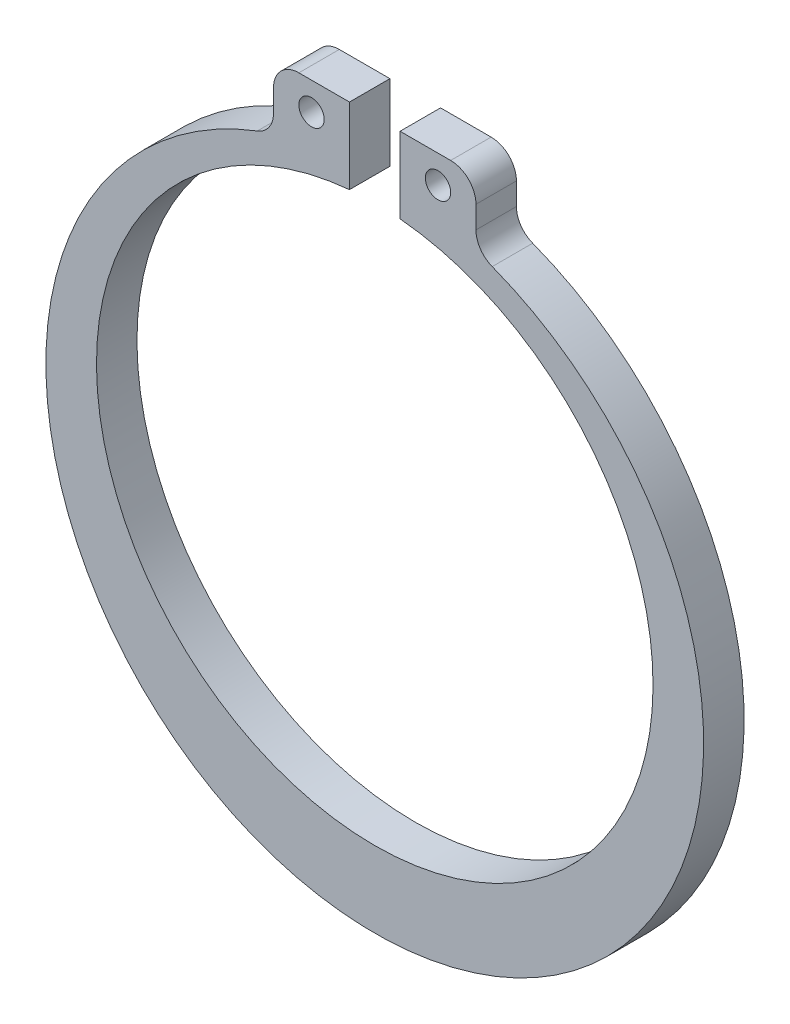
ISO-10303-21;
HEADER;
FILE_DESCRIPTION(('STEP AP214'),'2;1');
FILE_NAME('part.step','',(''),(''),'','','');
FILE_SCHEMA(('AUTOMOTIVE_DESIGN { 1 0 10303 214 1 1 1 1 }'));
ENDSEC;
DATA;
#1=APPLICATION_CONTEXT('core data for automotive mechanical design processes');
#2=APPLICATION_PROTOCOL_DEFINITION('international standard','automotive_design',2000,#1);
#3=PRODUCT_CONTEXT('',#1,'mechanical');
#4=PRODUCT('Part','Part','',(#3));
#5=PRODUCT_RELATED_PRODUCT_CATEGORY('part','',(#4));
#6=PRODUCT_DEFINITION_FORMATION('','',#4);
#7=PRODUCT_DEFINITION_CONTEXT('part definition',#1,'design');
#8=PRODUCT_DEFINITION('design','',#6,#7);
#9=PRODUCT_DEFINITION_SHAPE('','',#8);
#10=(LENGTH_UNIT() NAMED_UNIT(*) SI_UNIT(.MILLI.,.METRE.));
#11=(NAMED_UNIT(*) PLANE_ANGLE_UNIT() SI_UNIT($,.RADIAN.));
#12=(NAMED_UNIT(*) SI_UNIT($,.STERADIAN.) SOLID_ANGLE_UNIT());
#13=UNCERTAINTY_MEASURE_WITH_UNIT(LENGTH_MEASURE(1.E-05),#10,'distance_accuracy_value','');
#14=(GEOMETRIC_REPRESENTATION_CONTEXT(3) GLOBAL_UNCERTAINTY_ASSIGNED_CONTEXT((#13)) GLOBAL_UNIT_ASSIGNED_CONTEXT((#10,
#11,#12)) REPRESENTATION_CONTEXT('',''));
#15=CARTESIAN_POINT('',(0.,0.,0.));
#16=DIRECTION('',(0.,0.,1.));
#17=DIRECTION('',(1.,0.,0.));
#18=AXIS2_PLACEMENT_3D('',#15,#16,#17);
#19=CARTESIAN_POINT('',(0.5,0.,0.400000000000001));
#20=DIRECTION('',(1.,0.,0.));
#21=DIRECTION('',(0.,1.,0.));
#22=AXIS2_PLACEMENT_3D('',#19,#20,#21);
#23=PLANE('',#22);
#24=DIRECTION('',(0.,-1.,0.));
#25=VECTOR('',#24,1.);
#26=CARTESIAN_POINT('',(0.5,0.,-0.400000000000001));
#27=LINE('',#26,#25);
#28=CARTESIAN_POINT('',(0.5,6.97722557505166,-0.400000000000001));
#29=VERTEX_POINT('',#28);
#30=CARTESIAN_POINT('',(0.5,5.47722557505166,-0.400000000000001));
#31=VERTEX_POINT('',#30);
#32=EDGE_CURVE('E183',#29,#31,#27,.T.);
#33=ORIENTED_EDGE('',*,*,#32,.T.);
#34=DIRECTION('',(0.,0.,-1.));
#35=VECTOR('',#34,1.);
#36=CARTESIAN_POINT('',(0.5,5.47722557505166,0.400000000000001));
#37=LINE('',#36,#35);
#38=CARTESIAN_POINT('',(0.5,5.47722557505166,0.400000000000001));
#39=VERTEX_POINT('',#38);
#40=EDGE_CURVE('E197',#39,#31,#37,.T.);
#41=ORIENTED_EDGE('',*,*,#40,.F.);
#42=DIRECTION('',(0.,-1.,0.));
#43=VECTOR('',#42,1.);
#44=CARTESIAN_POINT('',(0.5,0.,0.400000000000001));
#45=LINE('',#44,#43);
#46=CARTESIAN_POINT('',(0.5,6.97722557505166,0.400000000000001));
#47=VERTEX_POINT('',#46);
#48=EDGE_CURVE('E167',#47,#39,#45,.T.);
#49=ORIENTED_EDGE('',*,*,#48,.F.);
#50=DIRECTION('',(0.,0.,-1.));
#51=VECTOR('',#50,1.);
#52=CARTESIAN_POINT('',(0.5,6.97722557505166,0.400000000000001));
#53=LINE('',#52,#51);
#54=EDGE_CURVE('E180',#47,#29,#53,.T.);
#55=ORIENTED_EDGE('',*,*,#54,.T.);
#56=EDGE_LOOP('',(#33,#41,#49,#55));
#57=FACE_BOUND('',#56,.T.);
#58=ADVANCED_FACE('F36',(#57),#23,.F.);
#59=CARTESIAN_POINT('',(0.,0.,0.400000000000001));
#60=DIRECTION('',(0.,0.,-1.));
#61=DIRECTION('',(-1.,0.,0.));
#62=AXIS2_PLACEMENT_3D('',#59,#60,#61);
#63=CYLINDRICAL_SURFACE('',#62,5.5);
#64=CARTESIAN_POINT('',(0.,0.,-0.400000000000001));
#65=DIRECTION('',(0.,0.,1.));
#66=DIRECTION('',(1.,0.,0.));
#67=AXIS2_PLACEMENT_3D('',#64,#65,#66);
#68=CIRCLE('',#67,5.5);
#69=CARTESIAN_POINT('',(-0.5,5.47722557505166,-0.400000000000001));
#70=VERTEX_POINT('',#69);
#71=EDGE_CURVE('E186',#31,#70,#68,.F.);
#72=ORIENTED_EDGE('',*,*,#71,.T.);
#73=DIRECTION('',(0.,0.,-1.));
#74=VECTOR('',#73,1.);
#75=CARTESIAN_POINT('',(-0.5,5.47722557505166,0.400000000000001));
#76=LINE('',#75,#74);
#77=CARTESIAN_POINT('',(-0.5,5.47722557505166,0.400000000000001));
#78=VERTEX_POINT('',#77);
#79=EDGE_CURVE('E134',#78,#70,#76,.T.);
#80=ORIENTED_EDGE('',*,*,#79,.F.);
#81=CARTESIAN_POINT('',(0.,0.,0.400000000000001));
#82=DIRECTION('',(0.,0.,1.));
#83=DIRECTION('',(1.,0.,0.));
#84=AXIS2_PLACEMENT_3D('',#81,#82,#83);
#85=CIRCLE('',#84,5.5);
#86=EDGE_CURVE('E145',#39,#78,#85,.F.);
#87=ORIENTED_EDGE('',*,*,#86,.F.);
#88=ORIENTED_EDGE('',*,*,#40,.T.);
#89=EDGE_LOOP('',(#72,#80,#87,#88));
#90=FACE_BOUND('',#89,.T.);
#91=ADVANCED_FACE('F267',(#90),#63,.F.);
#92=CARTESIAN_POINT('',(0.,-0.5,0.400000000000001));
#93=DIRECTION('',(0.,0.,-1.));
#94=DIRECTION('',(-1.,0.,0.));
#95=AXIS2_PLACEMENT_3D('',#92,#93,#94);
#96=CYLINDRICAL_SURFACE('',#95,6.5);
#97=CARTESIAN_POINT('',(0.,-0.5,0.400000000000001));
#98=DIRECTION('',(0.,0.,1.));
#99=DIRECTION('',(1.,0.,0.));
#100=AXIS2_PLACEMENT_3D('',#97,#98,#99);
#101=CIRCLE('',#100,6.5);
#102=CARTESIAN_POINT('',(2.32142857142857,5.57132352850308,0.400000000000001));
#103=VERTEX_POINT('',#102);
#104=CARTESIAN_POINT('',(-2.32142857142857,5.57132352850308,0.400000000000001));
#105=VERTEX_POINT('',#104);
#106=EDGE_CURVE('E171',#103,#105,#101,.F.);
#107=ORIENTED_EDGE('',*,*,#106,.T.);
#108=DIRECTION('',(0.,0.,-1.));
#109=VECTOR('',#108,1.);
#110=CARTESIAN_POINT('',(-2.32142857142857,5.57132352850308,0.400000000000001));
#111=LINE('',#110,#109);
#112=CARTESIAN_POINT('',(-2.32142857142857,5.57132352850308,-0.400000000000001));
#113=VERTEX_POINT('',#112);
#114=EDGE_CURVE('E218',#105,#113,#111,.T.);
#115=ORIENTED_EDGE('',*,*,#114,.T.);
#116=CARTESIAN_POINT('',(0.,-0.5,-0.400000000000001));
#117=DIRECTION('',(0.,0.,1.));
#118=DIRECTION('',(1.,0.,0.));
#119=AXIS2_PLACEMENT_3D('',#116,#117,#118);
#120=CIRCLE('',#119,6.5);
#121=CARTESIAN_POINT('',(2.32142857142857,5.57132352850308,-0.400000000000001));
#122=VERTEX_POINT('',#121);
#123=EDGE_CURVE('E188',#122,#113,#120,.F.);
#124=ORIENTED_EDGE('',*,*,#123,.F.);
#125=DIRECTION('',(0.,0.,-1.));
#126=VECTOR('',#125,1.);
#127=CARTESIAN_POINT('',(2.32142857142857,5.57132352850308,0.400000000000001));
#128=LINE('',#127,#126);
#129=EDGE_CURVE('E205',#122,#103,#128,.F.);
#130=ORIENTED_EDGE('',*,*,#129,.T.);
#131=EDGE_LOOP('',(#107,#115,#124,#130));
#132=FACE_BOUND('',#131,.T.);
#133=ADVANCED_FACE('F244',(#132),#96,.T.);
#134=CARTESIAN_POINT('',(2.,0.,0.400000000000001));
#135=DIRECTION('',(1.,0.,0.));
#136=DIRECTION('',(0.,1.,0.));
#137=AXIS2_PLACEMENT_3D('',#134,#135,#136);
#138=PLANE('',#137);
#139=DIRECTION('',(0.,-1.,0.));
#140=VECTOR('',#139,1.);
#141=CARTESIAN_POINT('',(2.,0.,0.400000000000001));
#142=LINE('',#141,#140);
#143=CARTESIAN_POINT('',(2.,6.47722557505166,0.400000000000001));
#144=VERTEX_POINT('',#143);
#145=CARTESIAN_POINT('',(2.,6.03834841531101,0.400000000000001));
#146=VERTEX_POINT('',#145);
#147=EDGE_CURVE('E174',#144,#146,#142,.T.);
#148=ORIENTED_EDGE('',*,*,#147,.T.);
#149=DIRECTION('',(0.,0.,1.));
#150=VECTOR('',#149,1.);
#151=CARTESIAN_POINT('',(2.,6.03834841531101,-0.400000000000001));
#152=LINE('',#151,#150);
#153=CARTESIAN_POINT('',(2.,6.03834841531101,-0.400000000000001));
#154=VERTEX_POINT('',#153);
#155=EDGE_CURVE('E202',#146,#154,#152,.F.);
#156=ORIENTED_EDGE('',*,*,#155,.T.);
#157=DIRECTION('',(0.,-1.,0.));
#158=VECTOR('',#157,1.);
#159=CARTESIAN_POINT('',(2.,0.,-0.400000000000001));
#160=LINE('',#159,#158);
#161=CARTESIAN_POINT('',(2.,6.47722557505166,-0.400000000000001));
#162=VERTEX_POINT('',#161);
#163=EDGE_CURVE('E191',#162,#154,#160,.T.);
#164=ORIENTED_EDGE('',*,*,#163,.F.);
#165=DIRECTION('',(0.,0.,-1.));
#166=VECTOR('',#165,1.);
#167=CARTESIAN_POINT('',(2.,6.47722557505166,0.400000000000001));
#168=LINE('',#167,#166);
#169=EDGE_CURVE('E200',#162,#144,#168,.F.);
#170=ORIENTED_EDGE('',*,*,#169,.T.);
#171=EDGE_LOOP('',(#148,#156,#164,#170));
#172=FACE_BOUND('',#171,.T.);
#173=ADVANCED_FACE('F252',(#172),#138,.T.);
#174=CARTESIAN_POINT('',(1.25,6.4279504930691,0.400000000000001));
#175=DIRECTION('',(0.,0.,-1.));
#176=DIRECTION('',(-1.,0.,0.));
#177=AXIS2_PLACEMENT_3D('',#174,#175,#176);
#178=CYLINDRICAL_SURFACE('',#177,0.25);
#179=CARTESIAN_POINT('',(1.25,6.4279504930691,0.400000000000001));
#180=DIRECTION('',(0.,0.,1.));
#181=DIRECTION('',(1.,0.,0.));
#182=AXIS2_PLACEMENT_3D('',#179,#180,#181);
#183=CIRCLE('',#182,0.25);
#184=CARTESIAN_POINT('',(1.5,6.4279504930691,0.400000000000001));
#185=VERTEX_POINT('',#184);
#186=EDGE_CURVE('E164',#185,#185,#183,.T.);
#187=ORIENTED_EDGE('',*,*,#186,.T.);
#188=EDGE_LOOP('',(#187));
#189=FACE_BOUND('',#188,.T.);
#190=CARTESIAN_POINT('',(1.25,6.4279504930691,-0.400000000000001));
#191=DIRECTION('',(0.,0.,1.));
#192=DIRECTION('',(1.,0.,0.));
#193=AXIS2_PLACEMENT_3D('',#190,#191,#192);
#194=CIRCLE('',#193,0.25);
#195=CARTESIAN_POINT('',(1.5,6.4279504930691,-0.400000000000001));
#196=VERTEX_POINT('',#195);
#197=EDGE_CURVE('E133',#196,#196,#194,.T.);
#198=ORIENTED_EDGE('',*,*,#197,.F.);
#199=EDGE_LOOP('',(#198));
#200=FACE_BOUND('',#199,.T.);
#201=ADVANCED_FACE('F282',(#189,#200),#178,.F.);
#202=CARTESIAN_POINT('',(0.,6.97722557505166,0.400000000000001));
#203=DIRECTION('',(0.,1.,0.));
#204=DIRECTION('',(0.,0.,1.));
#205=AXIS2_PLACEMENT_3D('',#202,#203,#204);
#206=PLANE('',#205);
#207=DIRECTION('',(1.,0.,0.));
#208=VECTOR('',#207,1.);
#209=CARTESIAN_POINT('',(0.,6.97722557505166,0.400000000000001));
#210=LINE('',#209,#208);
#211=CARTESIAN_POINT('',(1.5,6.97722557505166,0.400000000000001));
#212=VERTEX_POINT('',#211);
#213=EDGE_CURVE('E177',#47,#212,#210,.T.);
#214=ORIENTED_EDGE('',*,*,#213,.T.);
#215=DIRECTION('',(0.,0.,-1.));
#216=VECTOR('',#215,1.);
#217=CARTESIAN_POINT('',(1.5,6.97722557505166,0.400000000000001));
#218=LINE('',#217,#216);
#219=CARTESIAN_POINT('',(1.5,6.97722557505166,-0.400000000000001));
#220=VERTEX_POINT('',#219);
#221=EDGE_CURVE('E207',#212,#220,#218,.T.);
#222=ORIENTED_EDGE('',*,*,#221,.T.);
#223=DIRECTION('',(1.,0.,0.));
#224=VECTOR('',#223,1.);
#225=CARTESIAN_POINT('',(0.,6.97722557505166,-0.400000000000001));
#226=LINE('',#225,#224);
#227=EDGE_CURVE('E168',#29,#220,#226,.T.);
#228=ORIENTED_EDGE('',*,*,#227,.F.);
#229=ORIENTED_EDGE('',*,*,#54,.F.);
#230=EDGE_LOOP('',(#214,#222,#228,#229));
#231=FACE_BOUND('',#230,.T.);
#232=ADVANCED_FACE('F260',(#231),#206,.T.);
#233=CARTESIAN_POINT('',(0.,0.,0.400000000000001));
#234=DIRECTION('',(0.,0.,1.));
#235=DIRECTION('',(1.,0.,0.));
#236=AXIS2_PLACEMENT_3D('',#233,#234,#235);
#237=PLANE('',#236);
#238=ORIENTED_EDGE('',*,*,#186,.F.);
#239=EDGE_LOOP('',(#238));
#240=FACE_BOUND('',#239,.T.);
#241=DIRECTION('',(-1.,0.,0.));
#242=VECTOR('',#241,1.);
#243=CARTESIAN_POINT('',(0.,6.97722557505166,0.400000000000001));
#244=LINE('',#243,#242);
#245=CARTESIAN_POINT('',(-0.5,6.97722557505166,0.400000000000001));
#246=VERTEX_POINT('',#245);
#247=CARTESIAN_POINT('',(-1.5,6.97722557505166,0.400000000000001));
#248=VERTEX_POINT('',#247);
#249=EDGE_CURVE('E136',#246,#248,#244,.T.);
#250=ORIENTED_EDGE('',*,*,#249,.T.);
#251=CARTESIAN_POINT('',(-1.5,6.47722557505166,0.400000000000001));
#252=DIRECTION('',(0.,0.,1.));
#253=DIRECTION('',(1.,0.,0.));
#254=AXIS2_PLACEMENT_3D('',#251,#252,#253);
#255=CIRCLE('',#254,0.5);
#256=CARTESIAN_POINT('',(-2.,6.47722557505166,0.400000000000001));
#257=VERTEX_POINT('',#256);
#258=EDGE_CURVE('E228',#248,#257,#255,.T.);
#259=ORIENTED_EDGE('',*,*,#258,.T.);
#260=DIRECTION('',(0.,-1.,0.));
#261=VECTOR('',#260,1.);
#262=CARTESIAN_POINT('',(-2.,0.,0.400000000000001));
#263=LINE('',#262,#261);
#264=CARTESIAN_POINT('',(-2.,6.03834841531101,0.400000000000001));
#265=VERTEX_POINT('',#264);
#266=EDGE_CURVE('E140',#257,#265,#263,.T.);
#267=ORIENTED_EDGE('',*,*,#266,.T.);
#268=CARTESIAN_POINT('',(-2.5,6.03834841531101,0.400000000000001));
#269=DIRECTION('',(0.,0.,1.));
#270=DIRECTION('',(1.,0.,0.));
#271=AXIS2_PLACEMENT_3D('',#268,#269,#270);
#272=CIRCLE('',#271,0.5);
#273=EDGE_CURVE('E11',#265,#105,#272,.F.);
#274=ORIENTED_EDGE('',*,*,#273,.T.);
#275=ORIENTED_EDGE('',*,*,#106,.F.);
#276=CARTESIAN_POINT('',(2.5,6.03834841531101,0.400000000000001));
#277=DIRECTION('',(0.,0.,1.));
#278=DIRECTION('',(1.,0.,0.));
#279=AXIS2_PLACEMENT_3D('',#276,#277,#278);
#280=CIRCLE('',#279,0.5);
#281=EDGE_CURVE('E216',#103,#146,#280,.F.);
#282=ORIENTED_EDGE('',*,*,#281,.T.);
#283=ORIENTED_EDGE('',*,*,#147,.F.);
#284=CARTESIAN_POINT('',(1.5,6.47722557505166,0.400000000000001));
#285=DIRECTION('',(0.,0.,1.));
#286=DIRECTION('',(1.,0.,0.));
#287=AXIS2_PLACEMENT_3D('',#284,#285,#286);
#288=CIRCLE('',#287,0.5);
#289=EDGE_CURVE('E212',#144,#212,#288,.T.);
#290=ORIENTED_EDGE('',*,*,#289,.T.);
#291=ORIENTED_EDGE('',*,*,#213,.F.);
#292=ORIENTED_EDGE('',*,*,#48,.T.);
#293=ORIENTED_EDGE('',*,*,#86,.T.);
#294=DIRECTION('',(0.,-1.,0.));
#295=VECTOR('',#294,1.);
#296=CARTESIAN_POINT('',(-0.5,0.,0.400000000000001));
#297=LINE('',#296,#295);
#298=EDGE_CURVE('E130',#246,#78,#297,.T.);
#299=ORIENTED_EDGE('',*,*,#298,.F.);
#300=EDGE_LOOP('',(#250,#259,#267,#274,#275,#282,#283,#290,#291,#292,#293,#299));
#301=FACE_BOUND('',#300,.T.);
#302=CARTESIAN_POINT('',(-1.25,6.4279504930691,0.400000000000001));
#303=DIRECTION('',(0.,0.,-1.));
#304=DIRECTION('',(-1.,0.,0.));
#305=AXIS2_PLACEMENT_3D('',#302,#303,#304);
#306=CIRCLE('',#305,0.25);
#307=CARTESIAN_POINT('',(-1.5,6.4279504930691,0.400000000000001));
#308=VERTEX_POINT('',#307);
#309=EDGE_CURVE('E147',#308,#308,#306,.T.);
#310=ORIENTED_EDGE('',*,*,#309,.T.);
#311=EDGE_LOOP('',(#310));
#312=FACE_BOUND('',#311,.T.);
#313=ADVANCED_FACE('F142',(#240,#301,#312),#237,.T.);
#314=CARTESIAN_POINT('',(0.,0.,-0.400000000000001));
#315=DIRECTION('',(0.,0.,1.));
#316=DIRECTION('',(1.,0.,0.));
#317=AXIS2_PLACEMENT_3D('',#314,#315,#316);
#318=PLANE('',#317);
#319=ORIENTED_EDGE('',*,*,#197,.T.);
#320=EDGE_LOOP('',(#319));
#321=FACE_BOUND('',#320,.T.);
#322=DIRECTION('',(0.,-1.,0.));
#323=VECTOR('',#322,1.);
#324=CARTESIAN_POINT('',(-2.,0.,-0.400000000000001));
#325=LINE('',#324,#323);
#326=CARTESIAN_POINT('',(-2.,6.47722557505166,-0.400000000000001));
#327=VERTEX_POINT('',#326);
#328=CARTESIAN_POINT('',(-2.,6.03834841531101,-0.400000000000001));
#329=VERTEX_POINT('',#328);
#330=EDGE_CURVE('E150',#327,#329,#325,.T.);
#331=ORIENTED_EDGE('',*,*,#330,.F.);
#332=CARTESIAN_POINT('',(-1.5,6.47722557505166,-0.400000000000001));
#333=DIRECTION('',(0.,0.,1.));
#334=DIRECTION('',(1.,0.,0.));
#335=AXIS2_PLACEMENT_3D('',#332,#333,#334);
#336=CIRCLE('',#335,0.5);
#337=CARTESIAN_POINT('',(-1.5,6.97722557505166,-0.400000000000001));
#338=VERTEX_POINT('',#337);
#339=EDGE_CURVE('E59',#327,#338,#336,.F.);
#340=ORIENTED_EDGE('',*,*,#339,.T.);
#341=DIRECTION('',(-1.,0.,0.));
#342=VECTOR('',#341,1.);
#343=CARTESIAN_POINT('',(0.,6.97722557505166,-0.400000000000001));
#344=LINE('',#343,#342);
#345=CARTESIAN_POINT('',(-0.5,6.97722557505166,-0.400000000000001));
#346=VERTEX_POINT('',#345);
#347=EDGE_CURVE('E159',#346,#338,#344,.T.);
#348=ORIENTED_EDGE('',*,*,#347,.F.);
#349=DIRECTION('',(0.,-1.,0.));
#350=VECTOR('',#349,1.);
#351=CARTESIAN_POINT('',(-0.5,0.,-0.400000000000001));
#352=LINE('',#351,#350);
#353=EDGE_CURVE('E132',#346,#70,#352,.T.);
#354=ORIENTED_EDGE('',*,*,#353,.T.);
#355=ORIENTED_EDGE('',*,*,#71,.F.);
#356=ORIENTED_EDGE('',*,*,#32,.F.);
#357=ORIENTED_EDGE('',*,*,#227,.T.);
#358=CARTESIAN_POINT('',(1.5,6.47722557505166,-0.400000000000001));
#359=DIRECTION('',(0.,0.,1.));
#360=DIRECTION('',(1.,0.,0.));
#361=AXIS2_PLACEMENT_3D('',#358,#359,#360);
#362=CIRCLE('',#361,0.5);
#363=EDGE_CURVE('E210',#220,#162,#362,.F.);
#364=ORIENTED_EDGE('',*,*,#363,.T.);
#365=ORIENTED_EDGE('',*,*,#163,.T.);
#366=CARTESIAN_POINT('',(2.5,6.03834841531101,-0.400000000000001));
#367=DIRECTION('',(0.,0.,1.));
#368=DIRECTION('',(1.,0.,0.));
#369=AXIS2_PLACEMENT_3D('',#366,#367,#368);
#370=CIRCLE('',#369,0.5);
#371=EDGE_CURVE('E214',#154,#122,#370,.T.);
#372=ORIENTED_EDGE('',*,*,#371,.T.);
#373=ORIENTED_EDGE('',*,*,#123,.T.);
#374=CARTESIAN_POINT('',(-2.5,6.03834841531101,-0.400000000000001));
#375=DIRECTION('',(0.,0.,1.));
#376=DIRECTION('',(1.,0.,0.));
#377=AXIS2_PLACEMENT_3D('',#374,#375,#376);
#378=CIRCLE('',#377,0.5);
#379=EDGE_CURVE('E44',#113,#329,#378,.T.);
#380=ORIENTED_EDGE('',*,*,#379,.T.);
#381=EDGE_LOOP('',(#331,#340,#348,#354,#355,#356,#357,#364,#365,#372,#373,#380));
#382=FACE_BOUND('',#381,.T.);
#383=CARTESIAN_POINT('',(-1.25,6.4279504930691,-0.400000000000001));
#384=DIRECTION('',(0.,0.,-1.));
#385=DIRECTION('',(-1.,0.,0.));
#386=AXIS2_PLACEMENT_3D('',#383,#384,#385);
#387=CIRCLE('',#386,0.25);
#388=CARTESIAN_POINT('',(-1.5,6.4279504930691,-0.400000000000001));
#389=VERTEX_POINT('',#388);
#390=EDGE_CURVE('E155',#389,#389,#387,.T.);
#391=ORIENTED_EDGE('',*,*,#390,.F.);
#392=EDGE_LOOP('',(#391));
#393=FACE_BOUND('',#392,.T.);
#394=ADVANCED_FACE('F229',(#321,#382,#393),#318,.F.);
#395=CARTESIAN_POINT('',(2.5,6.03834841531101,0.400000000000001));
#396=DIRECTION('',(0.,0.,-1.));
#397=DIRECTION('',(-1.,0.,0.));
#398=AXIS2_PLACEMENT_3D('',#395,#396,#397);
#399=CYLINDRICAL_SURFACE('',#398,0.5);
#400=ORIENTED_EDGE('',*,*,#281,.F.);
#401=ORIENTED_EDGE('',*,*,#129,.F.);
#402=ORIENTED_EDGE('',*,*,#371,.F.);
#403=ORIENTED_EDGE('',*,*,#155,.F.);
#404=EDGE_LOOP('',(#400,#401,#402,#403));
#405=FACE_BOUND('',#404,.T.);
#406=ADVANCED_FACE('F247',(#405),#399,.F.);
#407=CARTESIAN_POINT('',(1.5,6.47722557505166,0.400000000000001));
#408=DIRECTION('',(0.,0.,-1.));
#409=DIRECTION('',(-1.,0.,0.));
#410=AXIS2_PLACEMENT_3D('',#407,#408,#409);
#411=CYLINDRICAL_SURFACE('',#410,0.5);
#412=ORIENTED_EDGE('',*,*,#289,.F.);
#413=ORIENTED_EDGE('',*,*,#169,.F.);
#414=ORIENTED_EDGE('',*,*,#363,.F.);
#415=ORIENTED_EDGE('',*,*,#221,.F.);
#416=EDGE_LOOP('',(#412,#413,#414,#415));
#417=FACE_BOUND('',#416,.T.);
#418=ADVANCED_FACE('F256',(#417),#411,.T.);
#419=CARTESIAN_POINT('',(-0.5,0.,0.400000000000001));
#420=DIRECTION('',(1.,0.,0.));
#421=DIRECTION('',(0.,1.,0.));
#422=AXIS2_PLACEMENT_3D('',#419,#420,#421);
#423=PLANE('',#422);
#424=ORIENTED_EDGE('',*,*,#353,.F.);
#425=DIRECTION('',(0.,0.,-1.));
#426=VECTOR('',#425,1.);
#427=CARTESIAN_POINT('',(-0.5,6.97722557505166,0.400000000000001));
#428=LINE('',#427,#426);
#429=EDGE_CURVE('E126',#246,#346,#428,.T.);
#430=ORIENTED_EDGE('',*,*,#429,.F.);
#431=ORIENTED_EDGE('',*,*,#298,.T.);
#432=ORIENTED_EDGE('',*,*,#79,.T.);
#433=EDGE_LOOP('',(#424,#430,#431,#432));
#434=FACE_BOUND('',#433,.T.);
#435=ADVANCED_FACE('F127',(#434),#423,.T.);
#436=CARTESIAN_POINT('',(0.,6.97722557505166,0.400000000000001));
#437=DIRECTION('',(0.,-1.,0.));
#438=DIRECTION('',(0.,0.,-1.));
#439=AXIS2_PLACEMENT_3D('',#436,#437,#438);
#440=PLANE('',#439);
#441=ORIENTED_EDGE('',*,*,#347,.T.);
#442=DIRECTION('',(0.,0.,-1.));
#443=VECTOR('',#442,1.);
#444=CARTESIAN_POINT('',(-1.5,6.97722557505166,0.400000000000001));
#445=LINE('',#444,#443);
#446=EDGE_CURVE('E51',#338,#248,#445,.F.);
#447=ORIENTED_EDGE('',*,*,#446,.T.);
#448=ORIENTED_EDGE('',*,*,#249,.F.);
#449=ORIENTED_EDGE('',*,*,#429,.T.);
#450=EDGE_LOOP('',(#441,#447,#448,#449));
#451=FACE_BOUND('',#450,.T.);
#452=ADVANCED_FACE('F137',(#451),#440,.F.);
#453=CARTESIAN_POINT('',(-2.,0.,0.400000000000001));
#454=DIRECTION('',(1.,0.,0.));
#455=DIRECTION('',(0.,1.,0.));
#456=AXIS2_PLACEMENT_3D('',#453,#454,#455);
#457=PLANE('',#456);
#458=ORIENTED_EDGE('',*,*,#330,.T.);
#459=DIRECTION('',(0.,0.,-1.));
#460=VECTOR('',#459,1.);
#461=CARTESIAN_POINT('',(-2.,6.03834841531101,0.400000000000001));
#462=LINE('',#461,#460);
#463=EDGE_CURVE('E224',#329,#265,#462,.F.);
#464=ORIENTED_EDGE('',*,*,#463,.T.);
#465=ORIENTED_EDGE('',*,*,#266,.F.);
#466=DIRECTION('',(0.,0.,-1.));
#467=VECTOR('',#466,1.);
#468=CARTESIAN_POINT('',(-2.,6.47722557505166,0.400000000000001));
#469=LINE('',#468,#467);
#470=EDGE_CURVE('E221',#257,#327,#469,.T.);
#471=ORIENTED_EDGE('',*,*,#470,.T.);
#472=EDGE_LOOP('',(#458,#464,#465,#471));
#473=FACE_BOUND('',#472,.T.);
#474=ADVANCED_FACE('F236',(#473),#457,.F.);
#475=CARTESIAN_POINT('',(-1.25,6.4279504930691,0.400000000000001));
#476=DIRECTION('',(0.,0.,-1.));
#477=DIRECTION('',(-1.,0.,0.));
#478=AXIS2_PLACEMENT_3D('',#475,#476,#477);
#479=CYLINDRICAL_SURFACE('',#478,0.25);
#480=ORIENTED_EDGE('',*,*,#309,.F.);
#481=EDGE_LOOP('',(#480));
#482=FACE_BOUND('',#481,.T.);
#483=ORIENTED_EDGE('',*,*,#390,.T.);
#484=EDGE_LOOP('',(#483));
#485=FACE_BOUND('',#484,.T.);
#486=ADVANCED_FACE('F273',(#482,#485),#479,.F.);
#487=CARTESIAN_POINT('',(-2.5,6.03834841531101,0.400000000000001));
#488=DIRECTION('',(0.,0.,-1.));
#489=DIRECTION('',(-1.,0.,0.));
#490=AXIS2_PLACEMENT_3D('',#487,#488,#489);
#491=CYLINDRICAL_SURFACE('',#490,0.5);
#492=ORIENTED_EDGE('',*,*,#273,.F.);
#493=ORIENTED_EDGE('',*,*,#463,.F.);
#494=ORIENTED_EDGE('',*,*,#379,.F.);
#495=ORIENTED_EDGE('',*,*,#114,.F.);
#496=EDGE_LOOP('',(#492,#493,#494,#495));
#497=FACE_BOUND('',#496,.T.);
#498=ADVANCED_FACE('F240',(#497),#491,.F.);
#499=CARTESIAN_POINT('',(-1.5,6.47722557505166,0.400000000000001));
#500=DIRECTION('',(0.,0.,-1.));
#501=DIRECTION('',(-1.,0.,0.));
#502=AXIS2_PLACEMENT_3D('',#499,#500,#501);
#503=CYLINDRICAL_SURFACE('',#502,0.5);
#504=ORIENTED_EDGE('',*,*,#258,.F.);
#505=ORIENTED_EDGE('',*,*,#446,.F.);
#506=ORIENTED_EDGE('',*,*,#339,.F.);
#507=ORIENTED_EDGE('',*,*,#470,.F.);
#508=EDGE_LOOP('',(#504,#505,#506,#507));
#509=FACE_BOUND('',#508,.T.);
#510=ADVANCED_FACE('F38',(#509),#503,.T.);
#511=CLOSED_SHELL('',(#58,#91,#133,#173,#201,#232,#313,#394,#406,#418,#435,#452,#474,#486,#498,#510));
#512=MANIFOLD_SOLID_BREP('B2',#511);
#513=ADVANCED_BREP_SHAPE_REPRESENTATION('',(#18,#512),#14);
#514=SHAPE_DEFINITION_REPRESENTATION(#9,#513);
ENDSEC;
END-ISO-10303-21;
